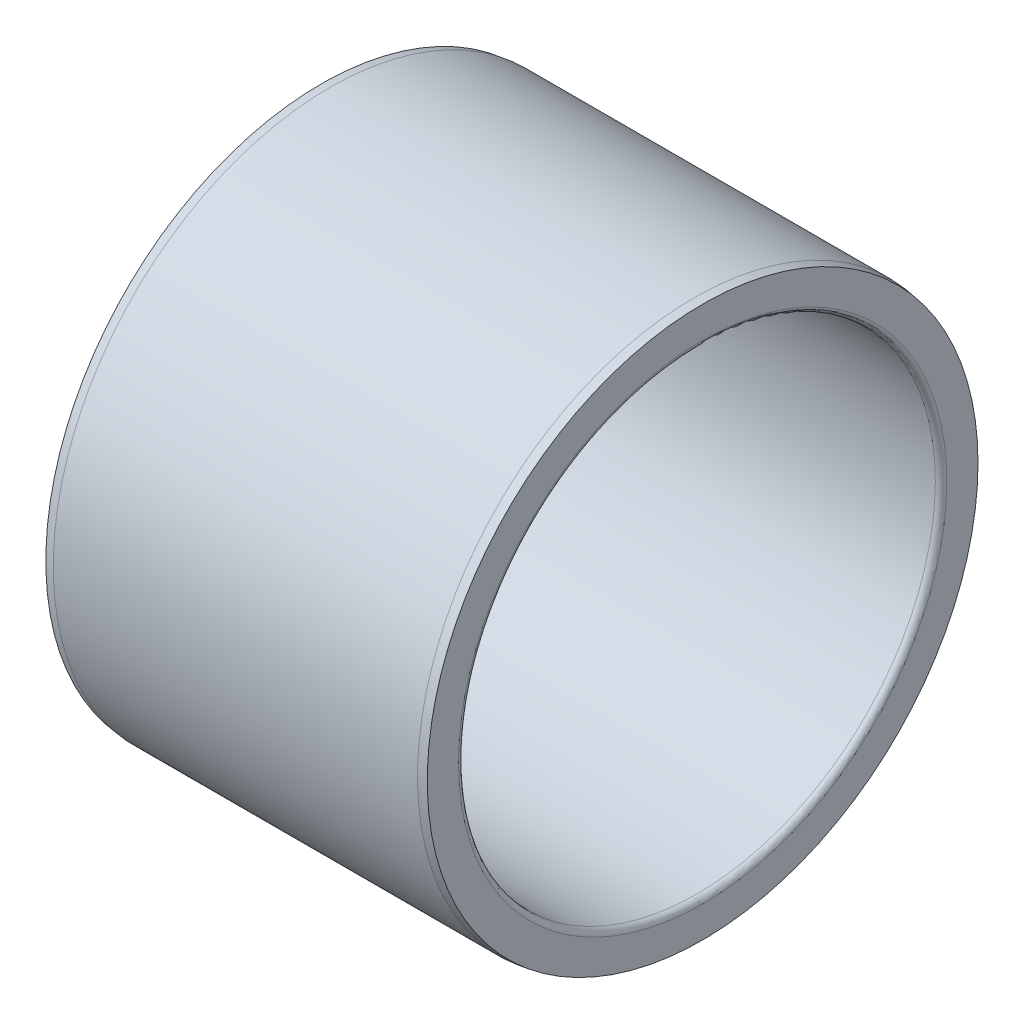
ISO-10303-21;
HEADER;
FILE_DESCRIPTION(('STEP AP214'),'2;1');
FILE_NAME('part.step','',(''),(''),'','','');
FILE_SCHEMA(('AUTOMOTIVE_DESIGN { 1 0 10303 214 1 1 1 1 }'));
ENDSEC;
DATA;
#1=APPLICATION_CONTEXT('core data for automotive mechanical design processes');
#2=APPLICATION_PROTOCOL_DEFINITION('international standard','automotive_design',2000,#1);
#3=PRODUCT_CONTEXT('',#1,'mechanical');
#4=PRODUCT('Part','Part','',(#3));
#5=PRODUCT_RELATED_PRODUCT_CATEGORY('part','',(#4));
#6=PRODUCT_DEFINITION_FORMATION('','',#4);
#7=PRODUCT_DEFINITION_CONTEXT('part definition',#1,'design');
#8=PRODUCT_DEFINITION('design','',#6,#7);
#9=PRODUCT_DEFINITION_SHAPE('','',#8);
#10=(LENGTH_UNIT() NAMED_UNIT(*) SI_UNIT(.MILLI.,.METRE.));
#11=(NAMED_UNIT(*) PLANE_ANGLE_UNIT() SI_UNIT($,.RADIAN.));
#12=(NAMED_UNIT(*) SI_UNIT($,.STERADIAN.) SOLID_ANGLE_UNIT());
#13=UNCERTAINTY_MEASURE_WITH_UNIT(LENGTH_MEASURE(1.E-05),#10,'distance_accuracy_value','');
#14=(GEOMETRIC_REPRESENTATION_CONTEXT(3) GLOBAL_UNCERTAINTY_ASSIGNED_CONTEXT((#13)) GLOBAL_UNIT_ASSIGNED_CONTEXT((#10,
#11,#12)) REPRESENTATION_CONTEXT('',''));
#15=CARTESIAN_POINT('',(0.,0.,0.));
#16=DIRECTION('',(0.,0.,1.));
#17=DIRECTION('',(1.,0.,0.));
#18=AXIS2_PLACEMENT_3D('',#15,#16,#17);
#19=CARTESIAN_POINT('',(0.,28.87625,0.));
#20=DIRECTION('',(-1.,0.,0.));
#21=DIRECTION('',(0.,0.,1.));
#22=AXIS2_PLACEMENT_3D('',#19,#20,#21);
#23=PLANE('',#22);
#24=CARTESIAN_POINT('',(0.,0.,0.));
#25=DIRECTION('',(1.,0.,0.));
#26=DIRECTION('',(0.,0.,-1.));
#27=AXIS2_PLACEMENT_3D('',#24,#25,#26);
#28=CIRCLE('',#27,25.6);
#29=CARTESIAN_POINT('',(0.,0.,-25.6));
#30=VERTEX_POINT('',#29);
#31=EDGE_CURVE('E44',#30,#30,#28,.T.);
#32=ORIENTED_EDGE('',*,*,#31,.T.);
#33=EDGE_LOOP('',(#32));
#34=FACE_BOUND('',#33,.T.);
#35=CARTESIAN_POINT('',(0.,0.,0.));
#36=DIRECTION('',(1.,0.,0.));
#37=DIRECTION('',(0.,0.,-1.));
#38=AXIS2_PLACEMENT_3D('',#35,#36,#37);
#39=CIRCLE('',#38,28.87625);
#40=CARTESIAN_POINT('',(0.,0.,-28.87625));
#41=VERTEX_POINT('',#40);
#42=EDGE_CURVE('E41',#41,#41,#39,.T.);
#43=ORIENTED_EDGE('',*,*,#42,.F.);
#44=EDGE_LOOP('',(#43));
#45=FACE_BOUND('',#44,.T.);
#46=ADVANCED_FACE('F15',(#34,#45),#23,.T.);
#47=CARTESIAN_POINT('',(0.599999999999872,0.,0.));
#48=DIRECTION('',(1.,0.,0.));
#49=DIRECTION('',(0.,0.,-1.));
#50=AXIS2_PLACEMENT_3D('',#47,#48,#49);
#51=TOROIDAL_SURFACE('',#50,25.6,0.599999999999872);
#52=CARTESIAN_POINT('',(0.6,0.,0.));
#53=DIRECTION('',(1.,0.,0.));
#54=DIRECTION('',(0.,0.,-1.));
#55=AXIS2_PLACEMENT_3D('',#52,#53,#54);
#56=CIRCLE('',#55,25.);
#57=CARTESIAN_POINT('',(0.6,0.,-25.));
#58=VERTEX_POINT('',#57);
#59=EDGE_CURVE('E38',#58,#58,#56,.T.);
#60=ORIENTED_EDGE('',*,*,#59,.T.);
#61=EDGE_LOOP('',(#60));
#62=FACE_BOUND('',#61,.T.);
#63=ORIENTED_EDGE('',*,*,#31,.F.);
#64=EDGE_LOOP('',(#63));
#65=FACE_BOUND('',#64,.T.);
#66=ADVANCED_FACE('F50',(#62,#65),#51,.T.);
#67=CARTESIAN_POINT('',(0.9,0.,0.));
#68=DIRECTION('',(1.,0.,0.));
#69=DIRECTION('',(0.,0.,-1.));
#70=AXIS2_PLACEMENT_3D('',#67,#68,#69);
#71=CONICAL_SURFACE('',#70,29.,0.136643162491093);
#72=ORIENTED_EDGE('',*,*,#42,.T.);
#73=EDGE_LOOP('',(#72));
#74=FACE_BOUND('',#73,.T.);
#75=CARTESIAN_POINT('',(0.899999999999999,0.,0.));
#76=DIRECTION('',(1.,0.,0.));
#77=DIRECTION('',(0.,0.,-1.));
#78=AXIS2_PLACEMENT_3D('',#75,#76,#77);
#79=CIRCLE('',#78,29.);
#80=CARTESIAN_POINT('',(0.899999999999999,0.,-29.));
#81=VERTEX_POINT('',#80);
#82=EDGE_CURVE('E35',#81,#81,#79,.T.);
#83=ORIENTED_EDGE('',*,*,#82,.F.);
#84=EDGE_LOOP('',(#83));
#85=FACE_BOUND('',#84,.T.);
#86=ADVANCED_FACE('F52',(#74,#85),#71,.T.);
#87=CARTESIAN_POINT('',(40.,0.,0.));
#88=DIRECTION('',(1.,0.,0.));
#89=DIRECTION('',(0.,0.,-1.));
#90=AXIS2_PLACEMENT_3D('',#87,#88,#89);
#91=CYLINDRICAL_SURFACE('',#90,25.);
#92=CARTESIAN_POINT('',(39.4,0.,0.));
#93=DIRECTION('',(1.,0.,0.));
#94=DIRECTION('',(0.,0.,-1.));
#95=AXIS2_PLACEMENT_3D('',#92,#93,#94);
#96=CIRCLE('',#95,25.);
#97=CARTESIAN_POINT('',(39.4,0.,-25.));
#98=VERTEX_POINT('',#97);
#99=EDGE_CURVE('E30',#98,#98,#96,.T.);
#100=ORIENTED_EDGE('',*,*,#99,.T.);
#101=EDGE_LOOP('',(#100));
#102=FACE_BOUND('',#101,.T.);
#103=ORIENTED_EDGE('',*,*,#59,.F.);
#104=EDGE_LOOP('',(#103));
#105=FACE_BOUND('',#104,.T.);
#106=ADVANCED_FACE('F60',(#102,#105),#91,.F.);
#107=CARTESIAN_POINT('',(40.,0.,0.));
#108=DIRECTION('',(1.,0.,0.));
#109=DIRECTION('',(0.,0.,-1.));
#110=AXIS2_PLACEMENT_3D('',#107,#108,#109);
#111=CYLINDRICAL_SURFACE('',#110,29.);
#112=ORIENTED_EDGE('',*,*,#82,.T.);
#113=EDGE_LOOP('',(#112));
#114=FACE_BOUND('',#113,.T.);
#115=CARTESIAN_POINT('',(39.1,0.,0.));
#116=DIRECTION('',(1.,0.,0.));
#117=DIRECTION('',(0.,0.,-1.));
#118=AXIS2_PLACEMENT_3D('',#115,#116,#117);
#119=CIRCLE('',#118,29.);
#120=CARTESIAN_POINT('',(39.1,0.,-29.));
#121=VERTEX_POINT('',#120);
#122=EDGE_CURVE('E26',#121,#121,#119,.T.);
#123=ORIENTED_EDGE('',*,*,#122,.F.);
#124=EDGE_LOOP('',(#123));
#125=FACE_BOUND('',#124,.T.);
#126=ADVANCED_FACE('F67',(#114,#125),#111,.T.);
#127=CARTESIAN_POINT('',(39.4,0.,0.));
#128=DIRECTION('',(1.,0.,0.));
#129=DIRECTION('',(0.,0.,-1.));
#130=AXIS2_PLACEMENT_3D('',#127,#128,#129);
#131=TOROIDAL_SURFACE('',#130,25.6,0.599999999999757);
#132=CARTESIAN_POINT('',(40.,0.,0.));
#133=DIRECTION('',(1.,0.,0.));
#134=DIRECTION('',(0.,0.,-1.));
#135=AXIS2_PLACEMENT_3D('',#132,#133,#134);
#136=CIRCLE('',#135,25.6);
#137=CARTESIAN_POINT('',(40.,0.,-25.6));
#138=VERTEX_POINT('',#137);
#139=EDGE_CURVE('E22',#138,#138,#136,.T.);
#140=ORIENTED_EDGE('',*,*,#139,.T.);
#141=EDGE_LOOP('',(#140));
#142=FACE_BOUND('',#141,.T.);
#143=ORIENTED_EDGE('',*,*,#99,.F.);
#144=EDGE_LOOP('',(#143));
#145=FACE_BOUND('',#144,.T.);
#146=ADVANCED_FACE('F71',(#142,#145),#131,.T.);
#147=CARTESIAN_POINT('',(40.,0.,0.));
#148=DIRECTION('',(-1.,0.,0.));
#149=DIRECTION('',(0.,0.,1.));
#150=AXIS2_PLACEMENT_3D('',#147,#148,#149);
#151=CONICAL_SURFACE('',#150,28.87625,0.136643162491093);
#152=ORIENTED_EDGE('',*,*,#122,.T.);
#153=EDGE_LOOP('',(#152));
#154=FACE_BOUND('',#153,.T.);
#155=CARTESIAN_POINT('',(40.,0.,0.));
#156=DIRECTION('',(1.,0.,0.));
#157=DIRECTION('',(0.,0.,-1.));
#158=AXIS2_PLACEMENT_3D('',#155,#156,#157);
#159=CIRCLE('',#158,28.87625);
#160=CARTESIAN_POINT('',(40.,0.,-28.87625));
#161=VERTEX_POINT('',#160);
#162=EDGE_CURVE('E10',#161,#161,#159,.T.);
#163=ORIENTED_EDGE('',*,*,#162,.F.);
#164=EDGE_LOOP('',(#163));
#165=FACE_BOUND('',#164,.T.);
#166=ADVANCED_FACE('F74',(#154,#165),#151,.T.);
#167=CARTESIAN_POINT('',(40.,25.6,0.));
#168=DIRECTION('',(1.,0.,0.));
#169=DIRECTION('',(0.,0.,-1.));
#170=AXIS2_PLACEMENT_3D('',#167,#168,#169);
#171=PLANE('',#170);
#172=ORIENTED_EDGE('',*,*,#162,.T.);
#173=EDGE_LOOP('',(#172));
#174=FACE_BOUND('',#173,.T.);
#175=ORIENTED_EDGE('',*,*,#139,.F.);
#176=EDGE_LOOP('',(#175));
#177=FACE_BOUND('',#176,.T.);
#178=ADVANCED_FACE('F17',(#174,#177),#171,.T.);
#179=CLOSED_SHELL('',(#46,#66,#86,#106,#126,#146,#166,#178));
#180=MANIFOLD_SOLID_BREP('B1',#179);
#181=ADVANCED_BREP_SHAPE_REPRESENTATION('',(#18,#180),#14);
#182=SHAPE_DEFINITION_REPRESENTATION(#9,#181);
ENDSEC;
END-ISO-10303-21;
